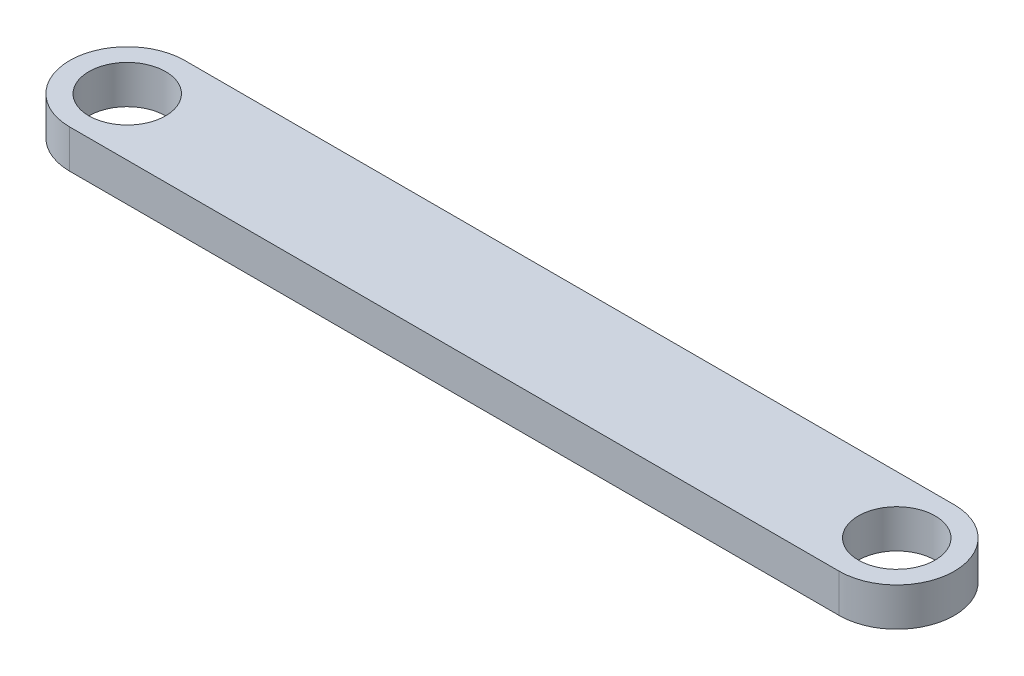
ISO-10303-21;
HEADER;
FILE_DESCRIPTION(('STEP AP214'),'2;1');
FILE_NAME('part.step','',(''),(''),'','','');
FILE_SCHEMA(('AUTOMOTIVE_DESIGN { 1 0 10303 214 1 1 1 1 }'));
ENDSEC;
DATA;
#1=APPLICATION_CONTEXT('core data for automotive mechanical design processes');
#2=APPLICATION_PROTOCOL_DEFINITION('international standard','automotive_design',2000,#1);
#3=PRODUCT_CONTEXT('',#1,'mechanical');
#4=PRODUCT('Part','Part','',(#3));
#5=PRODUCT_RELATED_PRODUCT_CATEGORY('part','',(#4));
#6=PRODUCT_DEFINITION_FORMATION('','',#4);
#7=PRODUCT_DEFINITION_CONTEXT('part definition',#1,'design');
#8=PRODUCT_DEFINITION('design','',#6,#7);
#9=PRODUCT_DEFINITION_SHAPE('','',#8);
#10=(LENGTH_UNIT() NAMED_UNIT(*) SI_UNIT(.MILLI.,.METRE.));
#11=(NAMED_UNIT(*) PLANE_ANGLE_UNIT() SI_UNIT($,.RADIAN.));
#12=(NAMED_UNIT(*) SI_UNIT($,.STERADIAN.) SOLID_ANGLE_UNIT());
#13=UNCERTAINTY_MEASURE_WITH_UNIT(LENGTH_MEASURE(1.E-05),#10,'distance_accuracy_value','');
#14=(GEOMETRIC_REPRESENTATION_CONTEXT(3) GLOBAL_UNCERTAINTY_ASSIGNED_CONTEXT((#13)) GLOBAL_UNIT_ASSIGNED_CONTEXT((#10,
#11,#12)) REPRESENTATION_CONTEXT('',''));
#15=CARTESIAN_POINT('',(0.,0.,0.));
#16=DIRECTION('',(0.,0.,1.));
#17=DIRECTION('',(1.,0.,0.));
#18=AXIS2_PLACEMENT_3D('',#15,#16,#17);
#19=CARTESIAN_POINT('',(0.,5.,0.));
#20=DIRECTION('',(0.,1.,0.));
#21=DIRECTION('',(0.,0.,1.));
#22=AXIS2_PLACEMENT_3D('',#19,#20,#21);
#23=PLANE('',#22);
#24=CARTESIAN_POINT('',(0.,5.,0.));
#25=DIRECTION('',(0.,1.,0.));
#26=DIRECTION('',(0.,0.,1.));
#27=AXIS2_PLACEMENT_3D('',#24,#25,#26);
#28=CIRCLE('',#27,5.);
#29=CARTESIAN_POINT('',(0.,5.,5.));
#30=VERTEX_POINT('',#29);
#31=EDGE_CURVE('E103',#30,#30,#28,.T.);
#32=ORIENTED_EDGE('',*,*,#31,.F.);
#33=EDGE_LOOP('',(#32));
#34=FACE_BOUND('',#33,.T.);
#35=CARTESIAN_POINT('',(0.,5.,0.));
#36=DIRECTION('',(0.,1.,0.));
#37=DIRECTION('',(0.,0.,1.));
#38=AXIS2_PLACEMENT_3D('',#35,#36,#37);
#39=CIRCLE('',#38,7.5);
#40=CARTESIAN_POINT('',(0.,5.,-7.5));
#41=VERTEX_POINT('',#40);
#42=CARTESIAN_POINT('',(0.,5.,7.5));
#43=VERTEX_POINT('',#42);
#44=EDGE_CURVE('E88',#41,#43,#39,.T.);
#45=ORIENTED_EDGE('',*,*,#44,.T.);
#46=DIRECTION('',(1.,0.,0.));
#47=VECTOR('',#46,1.);
#48=CARTESIAN_POINT('',(0.,5.,7.5));
#49=LINE('',#48,#47);
#50=CARTESIAN_POINT('',(100.280855600658,5.,7.5));
#51=VERTEX_POINT('',#50);
#52=EDGE_CURVE('E83',#43,#51,#49,.T.);
#53=ORIENTED_EDGE('',*,*,#52,.T.);
#54=CARTESIAN_POINT('',(100.280855600658,5.,0.));
#55=DIRECTION('',(0.,1.,0.));
#56=DIRECTION('',(0.,0.,1.));
#57=AXIS2_PLACEMENT_3D('',#54,#55,#56);
#58=CIRCLE('',#57,7.5);
#59=CARTESIAN_POINT('',(100.280855600658,5.,-7.5));
#60=VERTEX_POINT('',#59);
#61=EDGE_CURVE('E86',#51,#60,#58,.T.);
#62=ORIENTED_EDGE('',*,*,#61,.T.);
#63=DIRECTION('',(-1.,0.,0.));
#64=VECTOR('',#63,1.);
#65=CARTESIAN_POINT('',(0.,5.,-7.5));
#66=LINE('',#65,#64);
#67=EDGE_CURVE('E53',#60,#41,#66,.T.);
#68=ORIENTED_EDGE('',*,*,#67,.T.);
#69=EDGE_LOOP('',(#45,#53,#62,#68));
#70=FACE_BOUND('',#69,.T.);
#71=CARTESIAN_POINT('',(100.280855600658,5.,0.));
#72=DIRECTION('',(0.,1.,0.));
#73=DIRECTION('',(0.,0.,1.));
#74=AXIS2_PLACEMENT_3D('',#71,#72,#73);
#75=CIRCLE('',#74,5.);
#76=CARTESIAN_POINT('',(100.280855600658,5.,5.));
#77=VERTEX_POINT('',#76);
#78=EDGE_CURVE('E118',#77,#77,#75,.T.);
#79=ORIENTED_EDGE('',*,*,#78,.F.);
#80=EDGE_LOOP('',(#79));
#81=FACE_BOUND('',#80,.T.);
#82=ADVANCED_FACE('F36',(#34,#70,#81),#23,.T.);
#83=CARTESIAN_POINT('',(0.,0.,0.));
#84=DIRECTION('',(0.,1.,0.));
#85=DIRECTION('',(0.,0.,1.));
#86=AXIS2_PLACEMENT_3D('',#83,#84,#85);
#87=PLANE('',#86);
#88=CARTESIAN_POINT('',(0.,0.,0.));
#89=DIRECTION('',(0.,1.,0.));
#90=DIRECTION('',(0.,0.,1.));
#91=AXIS2_PLACEMENT_3D('',#88,#89,#90);
#92=CIRCLE('',#91,7.5);
#93=CARTESIAN_POINT('',(0.,0.,-7.5));
#94=VERTEX_POINT('',#93);
#95=CARTESIAN_POINT('',(0.,0.,7.5));
#96=VERTEX_POINT('',#95);
#97=EDGE_CURVE('E100',#94,#96,#92,.T.);
#98=ORIENTED_EDGE('',*,*,#97,.F.);
#99=DIRECTION('',(-1.,0.,0.));
#100=VECTOR('',#99,1.);
#101=CARTESIAN_POINT('',(0.,0.,-7.5));
#102=LINE('',#101,#100);
#103=CARTESIAN_POINT('',(100.280855600658,0.,-7.5));
#104=VERTEX_POINT('',#103);
#105=EDGE_CURVE('E76',#104,#94,#102,.T.);
#106=ORIENTED_EDGE('',*,*,#105,.F.);
#107=CARTESIAN_POINT('',(100.280855600658,0.,0.));
#108=DIRECTION('',(0.,1.,0.));
#109=DIRECTION('',(0.,0.,1.));
#110=AXIS2_PLACEMENT_3D('',#107,#108,#109);
#111=CIRCLE('',#110,7.5);
#112=CARTESIAN_POINT('',(100.280855600658,0.,7.5));
#113=VERTEX_POINT('',#112);
#114=EDGE_CURVE('E70',#113,#104,#111,.T.);
#115=ORIENTED_EDGE('',*,*,#114,.F.);
#116=DIRECTION('',(1.,0.,0.));
#117=VECTOR('',#116,1.);
#118=CARTESIAN_POINT('',(0.,0.,7.5));
#119=LINE('',#118,#117);
#120=EDGE_CURVE('E92',#96,#113,#119,.T.);
#121=ORIENTED_EDGE('',*,*,#120,.F.);
#122=EDGE_LOOP('',(#98,#106,#115,#121));
#123=FACE_BOUND('',#122,.T.);
#124=CARTESIAN_POINT('',(0.,0.,0.));
#125=DIRECTION('',(0.,1.,0.));
#126=DIRECTION('',(0.,0.,1.));
#127=AXIS2_PLACEMENT_3D('',#124,#125,#126);
#128=CIRCLE('',#127,5.);
#129=CARTESIAN_POINT('',(0.,0.,5.));
#130=VERTEX_POINT('',#129);
#131=EDGE_CURVE('E115',#130,#130,#128,.T.);
#132=ORIENTED_EDGE('',*,*,#131,.T.);
#133=EDGE_LOOP('',(#132));
#134=FACE_BOUND('',#133,.T.);
#135=CARTESIAN_POINT('',(100.280855600658,0.,0.));
#136=DIRECTION('',(0.,1.,0.));
#137=DIRECTION('',(0.,0.,1.));
#138=AXIS2_PLACEMENT_3D('',#135,#136,#137);
#139=CIRCLE('',#138,5.);
#140=CARTESIAN_POINT('',(100.280855600658,0.,5.));
#141=VERTEX_POINT('',#140);
#142=EDGE_CURVE('E121',#141,#141,#139,.T.);
#143=ORIENTED_EDGE('',*,*,#142,.T.);
#144=EDGE_LOOP('',(#143));
#145=FACE_BOUND('',#144,.T.);
#146=ADVANCED_FACE('F111',(#123,#134,#145),#87,.F.);
#147=CARTESIAN_POINT('',(0.,5.,0.));
#148=DIRECTION('',(0.,-1.,0.));
#149=DIRECTION('',(0.,0.,-1.));
#150=AXIS2_PLACEMENT_3D('',#147,#148,#149);
#151=CYLINDRICAL_SURFACE('',#150,7.5);
#152=ORIENTED_EDGE('',*,*,#97,.T.);
#153=DIRECTION('',(0.,-1.,0.));
#154=VECTOR('',#153,1.);
#155=CARTESIAN_POINT('',(0.,5.,7.5));
#156=LINE('',#155,#154);
#157=EDGE_CURVE('E11',#43,#96,#156,.T.);
#158=ORIENTED_EDGE('',*,*,#157,.F.);
#159=ORIENTED_EDGE('',*,*,#44,.F.);
#160=DIRECTION('',(0.,-1.,0.));
#161=VECTOR('',#160,1.);
#162=CARTESIAN_POINT('',(0.,5.,-7.5));
#163=LINE('',#162,#161);
#164=EDGE_CURVE('E96',#41,#94,#163,.T.);
#165=ORIENTED_EDGE('',*,*,#164,.T.);
#166=EDGE_LOOP('',(#152,#158,#159,#165));
#167=FACE_BOUND('',#166,.T.);
#168=ADVANCED_FACE('F38',(#167),#151,.T.);
#169=CARTESIAN_POINT('',(0.,5.,7.5));
#170=DIRECTION('',(0.,0.,-1.));
#171=DIRECTION('',(-1.,0.,0.));
#172=AXIS2_PLACEMENT_3D('',#169,#170,#171);
#173=PLANE('',#172);
#174=ORIENTED_EDGE('',*,*,#120,.T.);
#175=DIRECTION('',(0.,-1.,0.));
#176=VECTOR('',#175,1.);
#177=CARTESIAN_POINT('',(100.280855600658,5.,7.5));
#178=LINE('',#177,#176);
#179=EDGE_CURVE('E45',#51,#113,#178,.T.);
#180=ORIENTED_EDGE('',*,*,#179,.F.);
#181=ORIENTED_EDGE('',*,*,#52,.F.);
#182=ORIENTED_EDGE('',*,*,#157,.T.);
#183=EDGE_LOOP('',(#174,#180,#181,#182));
#184=FACE_BOUND('',#183,.T.);
#185=ADVANCED_FACE('F91',(#184),#173,.F.);
#186=CARTESIAN_POINT('',(100.280855600658,5.,0.));
#187=DIRECTION('',(0.,-1.,0.));
#188=DIRECTION('',(0.,0.,-1.));
#189=AXIS2_PLACEMENT_3D('',#186,#187,#188);
#190=CYLINDRICAL_SURFACE('',#189,7.5);
#191=ORIENTED_EDGE('',*,*,#114,.T.);
#192=DIRECTION('',(0.,-1.,0.));
#193=VECTOR('',#192,1.);
#194=CARTESIAN_POINT('',(100.280855600658,5.,-7.5));
#195=LINE('',#194,#193);
#196=EDGE_CURVE('E93',#60,#104,#195,.T.);
#197=ORIENTED_EDGE('',*,*,#196,.F.);
#198=ORIENTED_EDGE('',*,*,#61,.F.);
#199=ORIENTED_EDGE('',*,*,#179,.T.);
#200=EDGE_LOOP('',(#191,#197,#198,#199));
#201=FACE_BOUND('',#200,.T.);
#202=ADVANCED_FACE('F94',(#201),#190,.T.);
#203=CARTESIAN_POINT('',(0.,5.,-7.5));
#204=DIRECTION('',(0.,0.,1.));
#205=DIRECTION('',(1.,0.,0.));
#206=AXIS2_PLACEMENT_3D('',#203,#204,#205);
#207=PLANE('',#206);
#208=ORIENTED_EDGE('',*,*,#105,.T.);
#209=ORIENTED_EDGE('',*,*,#164,.F.);
#210=ORIENTED_EDGE('',*,*,#67,.F.);
#211=ORIENTED_EDGE('',*,*,#196,.T.);
#212=EDGE_LOOP('',(#208,#209,#210,#211));
#213=FACE_BOUND('',#212,.T.);
#214=ADVANCED_FACE('F108',(#213),#207,.F.);
#215=CARTESIAN_POINT('',(0.,5.,0.));
#216=DIRECTION('',(0.,-1.,0.));
#217=DIRECTION('',(0.,0.,-1.));
#218=AXIS2_PLACEMENT_3D('',#215,#216,#217);
#219=CYLINDRICAL_SURFACE('',#218,5.);
#220=ORIENTED_EDGE('',*,*,#31,.T.);
#221=EDGE_LOOP('',(#220));
#222=FACE_BOUND('',#221,.T.);
#223=ORIENTED_EDGE('',*,*,#131,.F.);
#224=EDGE_LOOP('',(#223));
#225=FACE_BOUND('',#224,.T.);
#226=ADVANCED_FACE('F138',(#222,#225),#219,.F.);
#227=CARTESIAN_POINT('',(100.280855600658,5.,0.));
#228=DIRECTION('',(0.,-1.,0.));
#229=DIRECTION('',(0.,0.,-1.));
#230=AXIS2_PLACEMENT_3D('',#227,#228,#229);
#231=CYLINDRICAL_SURFACE('',#230,5.);
#232=ORIENTED_EDGE('',*,*,#78,.T.);
#233=EDGE_LOOP('',(#232));
#234=FACE_BOUND('',#233,.T.);
#235=ORIENTED_EDGE('',*,*,#142,.F.);
#236=EDGE_LOOP('',(#235));
#237=FACE_BOUND('',#236,.T.);
#238=ADVANCED_FACE('F127',(#234,#237),#231,.F.);
#239=CLOSED_SHELL('',(#82,#146,#168,#185,#202,#214,#226,#238));
#240=MANIFOLD_SOLID_BREP('B2',#239);
#241=ADVANCED_BREP_SHAPE_REPRESENTATION('',(#18,#240),#14);
#242=SHAPE_DEFINITION_REPRESENTATION(#9,#241);
ENDSEC;
END-ISO-10303-21;
